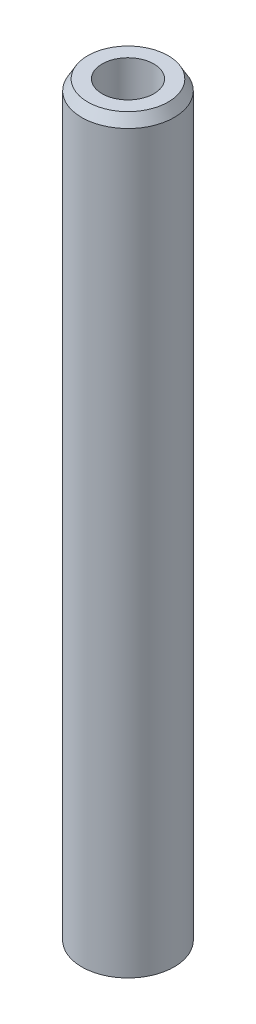
ISO-10303-21;
HEADER;
FILE_DESCRIPTION(('STEP AP214'),'2;1');
FILE_NAME('part.step','',(''),(''),'','','');
FILE_SCHEMA(('AUTOMOTIVE_DESIGN { 1 0 10303 214 1 1 1 1 }'));
ENDSEC;
DATA;
#1=APPLICATION_CONTEXT('core data for automotive mechanical design processes');
#2=APPLICATION_PROTOCOL_DEFINITION('international standard','automotive_design',2000,#1);
#3=PRODUCT_CONTEXT('',#1,'mechanical');
#4=PRODUCT('Part','Part','',(#3));
#5=PRODUCT_RELATED_PRODUCT_CATEGORY('part','',(#4));
#6=PRODUCT_DEFINITION_FORMATION('','',#4);
#7=PRODUCT_DEFINITION_CONTEXT('part definition',#1,'design');
#8=PRODUCT_DEFINITION('design','',#6,#7);
#9=PRODUCT_DEFINITION_SHAPE('','',#8);
#10=(LENGTH_UNIT() NAMED_UNIT(*) SI_UNIT(.MILLI.,.METRE.));
#11=(NAMED_UNIT(*) PLANE_ANGLE_UNIT() SI_UNIT($,.RADIAN.));
#12=(NAMED_UNIT(*) SI_UNIT($,.STERADIAN.) SOLID_ANGLE_UNIT());
#13=UNCERTAINTY_MEASURE_WITH_UNIT(LENGTH_MEASURE(1.E-05),#10,'distance_accuracy_value','');
#14=(GEOMETRIC_REPRESENTATION_CONTEXT(3) GLOBAL_UNCERTAINTY_ASSIGNED_CONTEXT((#13)) GLOBAL_UNIT_ASSIGNED_CONTEXT((#10,
#11,#12)) REPRESENTATION_CONTEXT('',''));
#15=CARTESIAN_POINT('',(0.,0.,0.));
#16=DIRECTION('',(0.,0.,1.));
#17=DIRECTION('',(1.,0.,0.));
#18=AXIS2_PLACEMENT_3D('',#15,#16,#17);
#19=CARTESIAN_POINT('',(0.,122.053708614473,0.));
#20=DIRECTION('',(0.,-1.,0.));
#21=DIRECTION('',(0.,0.,-1.));
#22=AXIS2_PLACEMENT_3D('',#19,#20,#21);
#23=CYLINDRICAL_SURFACE('',#22,7.5);
#24=CARTESIAN_POINT('',(0.,120.367595730789,0.));
#25=DIRECTION('',(0.,1.,0.));
#26=DIRECTION('',(0.,0.,1.));
#27=AXIS2_PLACEMENT_3D('',#24,#25,#26);
#28=CIRCLE('',#27,7.5);
#29=CARTESIAN_POINT('',(0.,120.367595730789,7.5));
#30=VERTEX_POINT('',#29);
#31=EDGE_CURVE('E50',#30,#30,#28,.F.);
#32=ORIENTED_EDGE('',*,*,#31,.T.);
#33=EDGE_LOOP('',(#32));
#34=FACE_BOUND('',#33,.T.);
#35=CARTESIAN_POINT('',(0.,0.97347772727871,0.));
#36=DIRECTION('',(0.,1.,0.));
#37=DIRECTION('',(0.,0.,1.));
#38=AXIS2_PLACEMENT_3D('',#35,#36,#37);
#39=CIRCLE('',#38,7.5);
#40=CARTESIAN_POINT('',(0.,0.97347772727871,7.5));
#41=VERTEX_POINT('',#40);
#42=EDGE_CURVE('E51',#41,#41,#39,.T.);
#43=ORIENTED_EDGE('',*,*,#42,.T.);
#44=EDGE_LOOP('',(#43));
#45=FACE_BOUND('',#44,.T.);
#46=ADVANCED_FACE('F39',(#34,#45),#23,.T.);
#47=CARTESIAN_POINT('',(0.,122.053708614473,0.));
#48=DIRECTION('',(0.,1.,0.));
#49=DIRECTION('',(0.,0.,1.));
#50=AXIS2_PLACEMENT_3D('',#47,#48,#49);
#51=PLANE('',#50);
#52=CARTESIAN_POINT('',(0.,122.053708614473,0.));
#53=DIRECTION('',(0.,1.,0.));
#54=DIRECTION('',(0.,0.,1.));
#55=AXIS2_PLACEMENT_3D('',#52,#53,#54);
#56=CIRCLE('',#55,6.52652227272126);
#57=CARTESIAN_POINT('',(0.,122.053708614473,6.52652227272126));
#58=VERTEX_POINT('',#57);
#59=EDGE_CURVE('E54',#58,#58,#56,.T.);
#60=ORIENTED_EDGE('',*,*,#59,.T.);
#61=EDGE_LOOP('',(#60));
#62=FACE_BOUND('',#61,.T.);
#63=CARTESIAN_POINT('',(0.,122.053708614473,0.));
#64=DIRECTION('',(0.,1.,0.));
#65=DIRECTION('',(0.,0.,1.));
#66=AXIS2_PLACEMENT_3D('',#63,#64,#65);
#67=CIRCLE('',#66,4.19895199422095);
#68=CARTESIAN_POINT('',(0.,122.053708614473,4.19895199422095));
#69=VERTEX_POINT('',#68);
#70=EDGE_CURVE('E58',#69,#69,#67,.T.);
#71=ORIENTED_EDGE('',*,*,#70,.F.);
#72=EDGE_LOOP('',(#71));
#73=FACE_BOUND('',#72,.T.);
#74=ADVANCED_FACE('F69',(#62,#73),#51,.T.);
#75=CARTESIAN_POINT('',(0.,0.,0.));
#76=DIRECTION('',(0.,1.,0.));
#77=DIRECTION('',(0.,0.,1.));
#78=AXIS2_PLACEMENT_3D('',#75,#76,#77);
#79=PLANE('',#78);
#80=CARTESIAN_POINT('',(0.,0.,0.));
#81=DIRECTION('',(0.,1.,0.));
#82=DIRECTION('',(0.,0.,1.));
#83=AXIS2_PLACEMENT_3D('',#80,#81,#82);
#84=CIRCLE('',#83,5.81388711631657);
#85=CARTESIAN_POINT('',(0.,0.,5.81388711631657));
#86=VERTEX_POINT('',#85);
#87=EDGE_CURVE('E10',#86,#86,#84,.F.);
#88=ORIENTED_EDGE('',*,*,#87,.T.);
#89=EDGE_LOOP('',(#88));
#90=FACE_BOUND('',#89,.T.);
#91=CARTESIAN_POINT('',(0.,0.,0.));
#92=DIRECTION('',(0.,1.,0.));
#93=DIRECTION('',(0.,0.,1.));
#94=AXIS2_PLACEMENT_3D('',#91,#92,#93);
#95=CIRCLE('',#94,4.19895199422095);
#96=CARTESIAN_POINT('',(0.,0.,4.19895199422095));
#97=VERTEX_POINT('',#96);
#98=EDGE_CURVE('E63',#97,#97,#95,.T.);
#99=ORIENTED_EDGE('',*,*,#98,.T.);
#100=EDGE_LOOP('',(#99));
#101=FACE_BOUND('',#100,.T.);
#102=ADVANCED_FACE('F75',(#90,#101),#79,.F.);
#103=CARTESIAN_POINT('',(0.,122.053708614473,0.));
#104=DIRECTION('',(0.,-1.,0.));
#105=DIRECTION('',(0.,0.,-1.));
#106=AXIS2_PLACEMENT_3D('',#103,#104,#105);
#107=CYLINDRICAL_SURFACE('',#106,4.19895199422095);
#108=ORIENTED_EDGE('',*,*,#70,.T.);
#109=EDGE_LOOP('',(#108));
#110=FACE_BOUND('',#109,.T.);
#111=ORIENTED_EDGE('',*,*,#98,.F.);
#112=EDGE_LOOP('',(#111));
#113=FACE_BOUND('',#112,.T.);
#114=ADVANCED_FACE('F70',(#110,#113),#107,.F.);
#115=CARTESIAN_POINT('',(0.,122.053708614473,0.));
#116=DIRECTION('',(0.,-1.,0.));
#117=DIRECTION('',(0.,0.,-1.));
#118=AXIS2_PLACEMENT_3D('',#115,#116,#117);
#119=CONICAL_SURFACE('',#118,6.52652227272126,0.523598775598299);
#120=ORIENTED_EDGE('',*,*,#31,.F.);
#121=EDGE_LOOP('',(#120));
#122=FACE_BOUND('',#121,.T.);
#123=ORIENTED_EDGE('',*,*,#59,.F.);
#124=EDGE_LOOP('',(#123));
#125=FACE_BOUND('',#124,.T.);
#126=ADVANCED_FACE('F81',(#122,#125),#119,.T.);
#127=CARTESIAN_POINT('',(0.,0.97347772727871,0.));
#128=DIRECTION('',(0.,1.,0.));
#129=DIRECTION('',(0.,0.,1.));
#130=AXIS2_PLACEMENT_3D('',#127,#128,#129);
#131=CONICAL_SURFACE('',#130,7.5,1.0471975511966);
#132=CARTESIAN_POINT('',(0.,0.,5.81388711631657));
#133=CARTESIAN_POINT('',(0.,0.0101403929924865,5.83145079218827));
#134=CARTESIAN_POINT('',(0.,0.020280785984973,5.84901446805998));
#135=CARTESIAN_POINT('',(0.,0.0405615719699461,5.88414181980338));
#136=CARTESIAN_POINT('',(0.,0.0507019649624327,5.90170549567508));
#137=CARTESIAN_POINT('',(0.,0.0709827509474058,5.93683284741849));
#138=CARTESIAN_POINT('',(0.,0.0811231439398925,5.95439652329019));
#139=CARTESIAN_POINT('',(0.,0.101403929924866,5.98952387503359));
#140=CARTESIAN_POINT('',(0.,0.111544322917352,6.0070875509053));
#141=CARTESIAN_POINT('',(0.,0.131825108902325,6.0422149026487));
#142=CARTESIAN_POINT('',(0.,0.141965501894812,6.0597785785204));
#143=CARTESIAN_POINT('',(0.,0.162246287879785,6.09490593026381));
#144=CARTESIAN_POINT('',(0.,0.172386680872271,6.11246960613551));
#145=CARTESIAN_POINT('',(0.,0.192667466857245,6.14759695787892));
#146=CARTESIAN_POINT('',(0.,0.202807859849731,6.16516063375062));
#147=CARTESIAN_POINT('',(0.,0.223088645834704,6.20028798549402));
#148=CARTESIAN_POINT('',(0.,0.233229038827191,6.21785166136573));
#149=CARTESIAN_POINT('',(0.,0.253509824812164,6.25297901310913));
#150=CARTESIAN_POINT('',(0.,0.26365021780465,6.27054268898083));
#151=CARTESIAN_POINT('',(0.,0.283931003789624,6.30567004072424));
#152=CARTESIAN_POINT('',(0.,0.29407139678211,6.32323371659594));
#153=CARTESIAN_POINT('',(0.,0.314352182767083,6.35836106833934));
#154=CARTESIAN_POINT('',(0.,0.32449257575957,6.37592474421105));
#155=CARTESIAN_POINT('',(0.,0.344773361744543,6.41105209595445));
#156=CARTESIAN_POINT('',(0.,0.354913754737029,6.42861577182615));
#157=CARTESIAN_POINT('',(0.,0.375194540722003,6.46374312356956));
#158=CARTESIAN_POINT('',(0.,0.385334933714489,6.48130679944126));
#159=CARTESIAN_POINT('',(0.,0.405615719699462,6.51643415118467));
#160=CARTESIAN_POINT('',(0.,0.415756112691949,6.53399782705637));
#161=CARTESIAN_POINT('',(0.,0.436036898676922,6.56912517879977));
#162=CARTESIAN_POINT('',(0.,0.446177291669409,6.58668885467148));
#163=CARTESIAN_POINT('',(0.,0.466458077654382,6.62181620641488));
#164=CARTESIAN_POINT('',(0.,0.476598470646868,6.63937988228658));
#165=CARTESIAN_POINT('',(0.,0.496879256631841,6.67450723402999));
#166=CARTESIAN_POINT('',(0.,0.507019649624328,6.69207090990169));
#167=CARTESIAN_POINT('',(0.,0.527300435609301,6.72719826164509));
#168=CARTESIAN_POINT('',(0.,0.537440828601788,6.7447619375168));
#169=CARTESIAN_POINT('',(0.,0.557721614586761,6.7798892892602));
#170=CARTESIAN_POINT('',(0.,0.567862007579247,6.7974529651319));
#171=CARTESIAN_POINT('',(0.,0.588142793564221,6.83258031687531));
#172=CARTESIAN_POINT('',(0.,0.598283186556707,6.85014399274701));
#173=CARTESIAN_POINT('',(0.,0.61856397254168,6.88527134449042));
#174=CARTESIAN_POINT('',(0.,0.628704365534167,6.90283502036212));
#175=CARTESIAN_POINT('',(0.,0.64898515151914,6.93796237210552));
#176=CARTESIAN_POINT('',(0.,0.659125544511627,6.95552604797723));
#177=CARTESIAN_POINT('',(0.,0.6794063304966,6.99065339972063));
#178=CARTESIAN_POINT('',(0.,0.689546723489086,7.00821707559233));
#179=CARTESIAN_POINT('',(0.,0.709827509474059,7.04334442733574));
#180=CARTESIAN_POINT('',(0.,0.719967902466546,7.06090810320744));
#181=CARTESIAN_POINT('',(0.,0.740248688451519,7.09603545495084));
#182=CARTESIAN_POINT('',(0.,0.750389081444005,7.11359913082255));
#183=CARTESIAN_POINT('',(0.,0.770669867428979,7.14872648256595));
#184=CARTESIAN_POINT('',(0.,0.780810260421465,7.16629015843765));
#185=CARTESIAN_POINT('',(0.,0.801091046406438,7.20141751018106));
#186=CARTESIAN_POINT('',(0.,0.811231439398925,7.21898118605276));
#187=CARTESIAN_POINT('',(0.,0.831512225383898,7.25410853779617));
#188=CARTESIAN_POINT('',(0.,0.841652618376384,7.27167221366787));
#189=CARTESIAN_POINT('',(0.,0.861933404361358,7.30679956541127));
#190=CARTESIAN_POINT('',(0.,0.872073797353844,7.32436324128298));
#191=CARTESIAN_POINT('',(0.,0.892354583338817,7.35949059302638));
#192=CARTESIAN_POINT('',(0.,0.902494976331304,7.37705426889808));
#193=CARTESIAN_POINT('',(0.,0.922775762316277,7.41218162064149));
#194=CARTESIAN_POINT('',(0.,0.932916155308763,7.42974529651319));
#195=CARTESIAN_POINT('',(0.,0.953196941293737,7.46487264825659));
#196=CARTESIAN_POINT('',(0.,0.963337334286223,7.4824363241283));
#197=CARTESIAN_POINT('',(0.,0.97347772727871,7.5));
#198=B_SPLINE_CURVE_WITH_KNOTS('',3,(#132,#133,#134,#135,#136,#137,#138,#139,#140,#141,#142,
#143,#144,#145,#146,#147,#148,#149,#150,#151,#152,#153,#154,#155,#156,#157,#158,#159,#160,#161,
#162,#163,#164,#165,#166,#167,#168,#169,#170,#171,#172,#173,#174,#175,#176,#177,#178,#179,#180,
#181,#182,#183,#184,#185,#186,#187,#188,#189,#190,#191,#192,#193,#194,#195,#196,#197),
.UNSPECIFIED.,.F.,.F.,(4,2,2,2,2,2,2,2,2,2,2,2,2,2,2,2,2,2,2,2,2,2,2,2,2,2,2,2,2,2,2,2,4),(0.,
0.0608423579549198,0.12168471590984,0.182527073864759,0.24336943181968,0.3042117897746,
0.36505414772952,0.42589650568444,0.48673886363936,0.54758122159428,0.6084235795492,
0.669265937504119,0.73010829545904,0.79095065341396,0.85179301136888,0.912635369323799,
0.97347772727872,1.03432008523364,1.09516244318856,1.15600480114348,1.2168471590984,
1.27768951705332,1.33853187500824,1.39937423296316,1.46021659091808,1.521058948873,
1.58190130682792,1.64274366478284,1.70358602273776,1.76442838069268,1.8252707386476,
1.88611309660252,1.94695545455744),.UNSPECIFIED.);
#199=EDGE_CURVE('BSEAM45',#86,#41,#198,.T.);
#200=ORIENTED_EDGE('',*,*,#87,.F.);
#201=ORIENTED_EDGE('',*,*,#42,.F.);
#202=ORIENTED_EDGE('',*,*,#199,.T.);
#203=ORIENTED_EDGE('',*,*,#199,.F.);
#204=EDGE_LOOP('',(#200,#202,#201,#203));
#205=FACE_BOUND('',#204,.T.);
#206=ADVANCED_FACE('F45',(#205),#131,.T.);
#207=CLOSED_SHELL('',(#46,#74,#102,#114,#126,#206));
#208=MANIFOLD_SOLID_BREP('B2',#207);
#209=ADVANCED_BREP_SHAPE_REPRESENTATION('',(#18,#208),#14);
#210=SHAPE_DEFINITION_REPRESENTATION(#9,#209);
ENDSEC;
END-ISO-10303-21;
